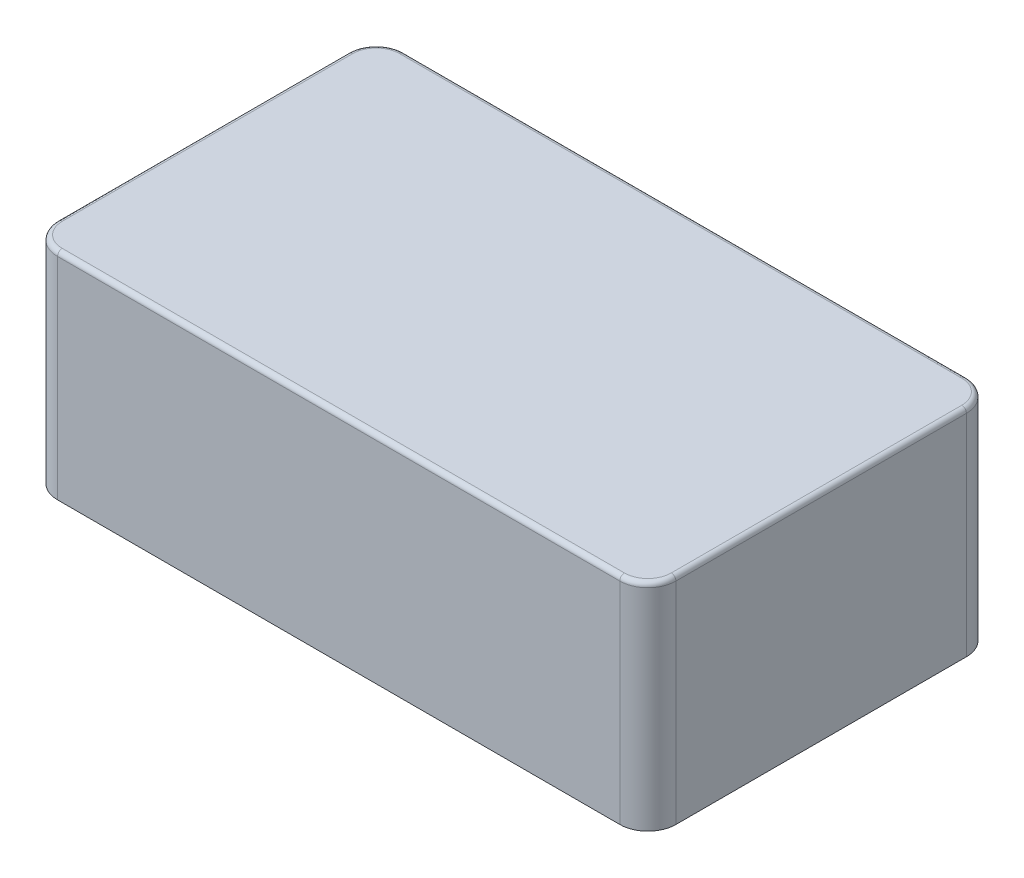
ISO-10303-21;
HEADER;
FILE_DESCRIPTION(('STEP AP214'),'2;1');
FILE_NAME('part.step','',(''),(''),'','','');
FILE_SCHEMA(('AUTOMOTIVE_DESIGN { 1 0 10303 214 1 1 1 1 }'));
ENDSEC;
DATA;
#1=APPLICATION_CONTEXT('core data for automotive mechanical design processes');
#2=APPLICATION_PROTOCOL_DEFINITION('international standard','automotive_design',2000,#1);
#3=PRODUCT_CONTEXT('',#1,'mechanical');
#4=PRODUCT('Part','Part','',(#3));
#5=PRODUCT_RELATED_PRODUCT_CATEGORY('part','',(#4));
#6=PRODUCT_DEFINITION_FORMATION('','',#4);
#7=PRODUCT_DEFINITION_CONTEXT('part definition',#1,'design');
#8=PRODUCT_DEFINITION('design','',#6,#7);
#9=PRODUCT_DEFINITION_SHAPE('','',#8);
#10=(LENGTH_UNIT() NAMED_UNIT(*) SI_UNIT(.MILLI.,.METRE.));
#11=(NAMED_UNIT(*) PLANE_ANGLE_UNIT() SI_UNIT($,.RADIAN.));
#12=(NAMED_UNIT(*) SI_UNIT($,.STERADIAN.) SOLID_ANGLE_UNIT());
#13=UNCERTAINTY_MEASURE_WITH_UNIT(LENGTH_MEASURE(1.E-05),#10,'distance_accuracy_value','');
#14=(GEOMETRIC_REPRESENTATION_CONTEXT(3) GLOBAL_UNCERTAINTY_ASSIGNED_CONTEXT((#13)) GLOBAL_UNIT_ASSIGNED_CONTEXT((#10,
#11,#12)) REPRESENTATION_CONTEXT('',''));
#15=CARTESIAN_POINT('',(0.,0.,0.));
#16=DIRECTION('',(0.,0.,1.));
#17=DIRECTION('',(1.,0.,0.));
#18=AXIS2_PLACEMENT_3D('',#15,#16,#17);
#19=CARTESIAN_POINT('',(30.,0.,-15.5));
#20=DIRECTION('',(0.,-1.,0.));
#21=DIRECTION('',(0.,0.,-1.));
#22=AXIS2_PLACEMENT_3D('',#19,#20,#21);
#23=PLANE('',#22);
#24=CARTESIAN_POINT('',(30.,0.,-15.5));
#25=DIRECTION('',(0.,1.,0.));
#26=DIRECTION('',(0.,0.,-1.));
#27=AXIS2_PLACEMENT_3D('',#24,#25,#26);
#28=CIRCLE('',#27,3.);
#29=CARTESIAN_POINT('',(33.,0.,-15.5));
#30=VERTEX_POINT('',#29);
#31=CARTESIAN_POINT('',(30.,0.,-18.5));
#32=VERTEX_POINT('',#31);
#33=EDGE_CURVE('E236',#30,#32,#28,.T.);
#34=ORIENTED_EDGE('',*,*,#33,.F.);
#35=DIRECTION('',(0.,0.,-1.));
#36=VECTOR('',#35,1.);
#37=CARTESIAN_POINT('',(33.,0.,-15.5));
#38=LINE('',#37,#36);
#39=CARTESIAN_POINT('',(33.,0.,15.5));
#40=VERTEX_POINT('',#39);
#41=EDGE_CURVE('E257',#40,#30,#38,.T.);
#42=ORIENTED_EDGE('',*,*,#41,.F.);
#43=CARTESIAN_POINT('',(30.,0.,15.5));
#44=DIRECTION('',(0.,1.,0.));
#45=DIRECTION('',(0.,0.,1.));
#46=AXIS2_PLACEMENT_3D('',#43,#44,#45);
#47=CIRCLE('',#46,3.);
#48=CARTESIAN_POINT('',(30.,0.,18.5));
#49=VERTEX_POINT('',#48);
#50=EDGE_CURVE('E254',#49,#40,#47,.T.);
#51=ORIENTED_EDGE('',*,*,#50,.F.);
#52=DIRECTION('',(1.,0.,0.));
#53=VECTOR('',#52,1.);
#54=CARTESIAN_POINT('',(-30.,0.,18.5));
#55=LINE('',#54,#53);
#56=CARTESIAN_POINT('',(-30.,0.,18.5));
#57=VERTEX_POINT('',#56);
#58=EDGE_CURVE('E251',#57,#49,#55,.T.);
#59=ORIENTED_EDGE('',*,*,#58,.F.);
#60=CARTESIAN_POINT('',(-30.,0.,15.5));
#61=DIRECTION('',(0.,1.,0.));
#62=DIRECTION('',(0.,0.,-1.));
#63=AXIS2_PLACEMENT_3D('',#60,#61,#62);
#64=CIRCLE('',#63,3.);
#65=CARTESIAN_POINT('',(-33.,0.,15.5));
#66=VERTEX_POINT('',#65);
#67=EDGE_CURVE('E248',#66,#57,#64,.T.);
#68=ORIENTED_EDGE('',*,*,#67,.F.);
#69=DIRECTION('',(0.,0.,1.));
#70=VECTOR('',#69,1.);
#71=CARTESIAN_POINT('',(-33.,0.,-15.5));
#72=LINE('',#71,#70);
#73=CARTESIAN_POINT('',(-33.,0.,-15.5));
#74=VERTEX_POINT('',#73);
#75=EDGE_CURVE('E245',#74,#66,#72,.T.);
#76=ORIENTED_EDGE('',*,*,#75,.F.);
#77=CARTESIAN_POINT('',(-30.,0.,-15.5));
#78=DIRECTION('',(0.,1.,0.));
#79=DIRECTION('',(0.,0.,-1.));
#80=AXIS2_PLACEMENT_3D('',#77,#78,#79);
#81=CIRCLE('',#80,3.);
#82=CARTESIAN_POINT('',(-30.,0.,-18.5));
#83=VERTEX_POINT('',#82);
#84=EDGE_CURVE('E242',#83,#74,#81,.T.);
#85=ORIENTED_EDGE('',*,*,#84,.F.);
#86=DIRECTION('',(-1.,0.,0.));
#87=VECTOR('',#86,1.);
#88=CARTESIAN_POINT('',(-30.,0.,-18.5));
#89=LINE('',#88,#87);
#90=EDGE_CURVE('E239',#32,#83,#89,.T.);
#91=ORIENTED_EDGE('',*,*,#90,.F.);
#92=EDGE_LOOP('',(#34,#42,#51,#59,#68,#76,#85,#91));
#93=FACE_BOUND('',#92,.T.);
#94=DIRECTION('',(0.,0.,-1.));
#95=VECTOR('',#94,1.);
#96=CARTESIAN_POINT('',(31.,0.,-13.5));
#97=LINE('',#96,#95);
#98=CARTESIAN_POINT('',(31.,0.,13.5));
#99=VERTEX_POINT('',#98);
#100=CARTESIAN_POINT('',(31.,0.,-13.5));
#101=VERTEX_POINT('',#100);
#102=EDGE_CURVE('E188',#99,#101,#97,.T.);
#103=ORIENTED_EDGE('',*,*,#102,.T.);
#104=CARTESIAN_POINT('',(28.,0.,-13.5));
#105=DIRECTION('',(0.,1.,0.));
#106=DIRECTION('',(0.,0.,1.));
#107=AXIS2_PLACEMENT_3D('',#104,#105,#106);
#108=CIRCLE('',#107,3.);
#109=CARTESIAN_POINT('',(28.,0.,-16.5));
#110=VERTEX_POINT('',#109);
#111=EDGE_CURVE('E202',#101,#110,#108,.T.);
#112=ORIENTED_EDGE('',*,*,#111,.T.);
#113=DIRECTION('',(-1.,0.,0.));
#114=VECTOR('',#113,1.);
#115=CARTESIAN_POINT('',(-28.,0.,-16.5));
#116=LINE('',#115,#114);
#117=CARTESIAN_POINT('',(-28.,0.,-16.5));
#118=VERTEX_POINT('',#117);
#119=EDGE_CURVE('E205',#110,#118,#116,.T.);
#120=ORIENTED_EDGE('',*,*,#119,.T.);
#121=CARTESIAN_POINT('',(-28.,0.,-13.5));
#122=DIRECTION('',(0.,1.,0.));
#123=DIRECTION('',(0.,0.,-1.));
#124=AXIS2_PLACEMENT_3D('',#121,#122,#123);
#125=CIRCLE('',#124,3.);
#126=CARTESIAN_POINT('',(-31.,0.,-13.5));
#127=VERTEX_POINT('',#126);
#128=EDGE_CURVE('E208',#118,#127,#125,.T.);
#129=ORIENTED_EDGE('',*,*,#128,.T.);
#130=DIRECTION('',(0.,0.,1.));
#131=VECTOR('',#130,1.);
#132=CARTESIAN_POINT('',(-31.,0.,-13.5));
#133=LINE('',#132,#131);
#134=CARTESIAN_POINT('',(-31.,0.,13.5));
#135=VERTEX_POINT('',#134);
#136=EDGE_CURVE('E211',#127,#135,#133,.T.);
#137=ORIENTED_EDGE('',*,*,#136,.T.);
#138=CARTESIAN_POINT('',(-28.,0.,13.5));
#139=DIRECTION('',(0.,1.,0.));
#140=DIRECTION('',(0.,0.,-1.));
#141=AXIS2_PLACEMENT_3D('',#138,#139,#140);
#142=CIRCLE('',#141,3.);
#143=CARTESIAN_POINT('',(-28.,0.,16.5));
#144=VERTEX_POINT('',#143);
#145=EDGE_CURVE('E214',#135,#144,#142,.T.);
#146=ORIENTED_EDGE('',*,*,#145,.T.);
#147=DIRECTION('',(1.,0.,0.));
#148=VECTOR('',#147,1.);
#149=CARTESIAN_POINT('',(-28.,0.,16.5));
#150=LINE('',#149,#148);
#151=CARTESIAN_POINT('',(28.,0.,16.5));
#152=VERTEX_POINT('',#151);
#153=EDGE_CURVE('E217',#144,#152,#150,.T.);
#154=ORIENTED_EDGE('',*,*,#153,.T.);
#155=CARTESIAN_POINT('',(28.,0.,13.5));
#156=DIRECTION('',(0.,1.,0.));
#157=DIRECTION('',(0.,0.,1.));
#158=AXIS2_PLACEMENT_3D('',#155,#156,#157);
#159=CIRCLE('',#158,3.);
#160=EDGE_CURVE('E220',#152,#99,#159,.T.);
#161=ORIENTED_EDGE('',*,*,#160,.T.);
#162=EDGE_LOOP('',(#103,#112,#120,#129,#137,#146,#154,#161));
#163=FACE_BOUND('',#162,.T.);
#164=ADVANCED_FACE('F34',(#93,#163),#23,.T.);
#165=CARTESIAN_POINT('',(30.,21.,-15.5));
#166=DIRECTION('',(0.,-1.,0.));
#167=DIRECTION('',(0.,0.,-1.));
#168=AXIS2_PLACEMENT_3D('',#165,#166,#167);
#169=CYLINDRICAL_SURFACE('',#168,3.);
#170=DIRECTION('',(0.,-1.,0.));
#171=VECTOR('',#170,1.);
#172=CARTESIAN_POINT('',(30.,21.,-18.5));
#173=LINE('',#172,#171);
#174=CARTESIAN_POINT('',(30.,22.5,-18.5));
#175=VERTEX_POINT('',#174);
#176=EDGE_CURVE('E274',#175,#32,#173,.T.);
#177=ORIENTED_EDGE('',*,*,#176,.F.);
#178=CARTESIAN_POINT('',(30.,22.5,-15.5));
#179=DIRECTION('',(0.,1.,0.));
#180=DIRECTION('',(0.,0.,1.));
#181=AXIS2_PLACEMENT_3D('',#178,#179,#180);
#182=CIRCLE('',#181,3.);
#183=CARTESIAN_POINT('',(33.,22.5,-15.5));
#184=VERTEX_POINT('',#183);
#185=EDGE_CURVE('E300',#175,#184,#182,.F.);
#186=ORIENTED_EDGE('',*,*,#185,.T.);
#187=DIRECTION('',(0.,-1.,0.));
#188=VECTOR('',#187,1.);
#189=CARTESIAN_POINT('',(33.,21.,-15.5));
#190=LINE('',#189,#188);
#191=EDGE_CURVE('E260',#184,#30,#190,.T.);
#192=ORIENTED_EDGE('',*,*,#191,.T.);
#193=ORIENTED_EDGE('',*,*,#33,.T.);
#194=EDGE_LOOP('',(#177,#186,#192,#193));
#195=FACE_BOUND('',#194,.T.);
#196=ADVANCED_FACE('F350',(#195),#169,.T.);
#197=CARTESIAN_POINT('',(-30.,21.,-18.5));
#198=DIRECTION('',(0.,0.,1.));
#199=DIRECTION('',(1.,0.,0.));
#200=AXIS2_PLACEMENT_3D('',#197,#198,#199);
#201=PLANE('',#200);
#202=DIRECTION('',(0.,-1.,0.));
#203=VECTOR('',#202,1.);
#204=CARTESIAN_POINT('',(-30.,21.,-18.5));
#205=LINE('',#204,#203);
#206=CARTESIAN_POINT('',(-30.,22.5,-18.5));
#207=VERTEX_POINT('',#206);
#208=EDGE_CURVE('E272',#207,#83,#205,.T.);
#209=ORIENTED_EDGE('',*,*,#208,.F.);
#210=DIRECTION('',(-1.,0.,0.));
#211=VECTOR('',#210,1.);
#212=CARTESIAN_POINT('',(30.,22.5,-18.5));
#213=LINE('',#212,#211);
#214=EDGE_CURVE('E298',#207,#175,#213,.F.);
#215=ORIENTED_EDGE('',*,*,#214,.T.);
#216=ORIENTED_EDGE('',*,*,#176,.T.);
#217=ORIENTED_EDGE('',*,*,#90,.T.);
#218=EDGE_LOOP('',(#209,#215,#216,#217));
#219=FACE_BOUND('',#218,.T.);
#220=ADVANCED_FACE('F353',(#219),#201,.F.);
#221=CARTESIAN_POINT('',(-30.,21.,-15.5));
#222=DIRECTION('',(0.,-1.,0.));
#223=DIRECTION('',(0.,0.,-1.));
#224=AXIS2_PLACEMENT_3D('',#221,#222,#223);
#225=CYLINDRICAL_SURFACE('',#224,3.);
#226=DIRECTION('',(0.,-1.,0.));
#227=VECTOR('',#226,1.);
#228=CARTESIAN_POINT('',(-33.,21.,-15.5));
#229=LINE('',#228,#227);
#230=CARTESIAN_POINT('',(-33.,22.5,-15.5));
#231=VERTEX_POINT('',#230);
#232=EDGE_CURVE('E270',#231,#74,#229,.T.);
#233=ORIENTED_EDGE('',*,*,#232,.F.);
#234=CARTESIAN_POINT('',(-30.,22.5,-15.5));
#235=DIRECTION('',(0.,1.,0.));
#236=DIRECTION('',(0.,0.,1.));
#237=AXIS2_PLACEMENT_3D('',#234,#235,#236);
#238=CIRCLE('',#237,3.);
#239=EDGE_CURVE('E296',#231,#207,#238,.F.);
#240=ORIENTED_EDGE('',*,*,#239,.T.);
#241=ORIENTED_EDGE('',*,*,#208,.T.);
#242=ORIENTED_EDGE('',*,*,#84,.T.);
#243=EDGE_LOOP('',(#233,#240,#241,#242));
#244=FACE_BOUND('',#243,.T.);
#245=ADVANCED_FACE('F417',(#244),#225,.T.);
#246=CARTESIAN_POINT('',(-33.,21.,-15.5));
#247=DIRECTION('',(1.,0.,0.));
#248=DIRECTION('',(0.,0.,-1.));
#249=AXIS2_PLACEMENT_3D('',#246,#247,#248);
#250=PLANE('',#249);
#251=DIRECTION('',(0.,-1.,0.));
#252=VECTOR('',#251,1.);
#253=CARTESIAN_POINT('',(-33.,21.,15.5));
#254=LINE('',#253,#252);
#255=CARTESIAN_POINT('',(-33.,22.5,15.5));
#256=VERTEX_POINT('',#255);
#257=EDGE_CURVE('E268',#256,#66,#254,.T.);
#258=ORIENTED_EDGE('',*,*,#257,.F.);
#259=DIRECTION('',(0.,0.,1.));
#260=VECTOR('',#259,1.);
#261=CARTESIAN_POINT('',(-33.,22.5,-15.5));
#262=LINE('',#261,#260);
#263=EDGE_CURVE('E293',#256,#231,#262,.F.);
#264=ORIENTED_EDGE('',*,*,#263,.T.);
#265=ORIENTED_EDGE('',*,*,#232,.T.);
#266=ORIENTED_EDGE('',*,*,#75,.T.);
#267=EDGE_LOOP('',(#258,#264,#265,#266));
#268=FACE_BOUND('',#267,.T.);
#269=ADVANCED_FACE('F383',(#268),#250,.F.);
#270=CARTESIAN_POINT('',(-30.,21.,15.5));
#271=DIRECTION('',(0.,-1.,0.));
#272=DIRECTION('',(0.,0.,-1.));
#273=AXIS2_PLACEMENT_3D('',#270,#271,#272);
#274=CYLINDRICAL_SURFACE('',#273,3.);
#275=DIRECTION('',(0.,-1.,0.));
#276=VECTOR('',#275,1.);
#277=CARTESIAN_POINT('',(-30.,21.,18.5));
#278=LINE('',#277,#276);
#279=CARTESIAN_POINT('',(-30.,22.5,18.5));
#280=VERTEX_POINT('',#279);
#281=EDGE_CURVE('E266',#280,#57,#278,.T.);
#282=ORIENTED_EDGE('',*,*,#281,.F.);
#283=CARTESIAN_POINT('',(-30.,22.5,15.5));
#284=DIRECTION('',(0.,1.,0.));
#285=DIRECTION('',(0.,0.,1.));
#286=AXIS2_PLACEMENT_3D('',#283,#284,#285);
#287=CIRCLE('',#286,3.);
#288=EDGE_CURVE('E11',#280,#256,#287,.F.);
#289=ORIENTED_EDGE('',*,*,#288,.T.);
#290=ORIENTED_EDGE('',*,*,#257,.T.);
#291=ORIENTED_EDGE('',*,*,#67,.T.);
#292=EDGE_LOOP('',(#282,#289,#290,#291));
#293=FACE_BOUND('',#292,.T.);
#294=ADVANCED_FACE('F380',(#293),#274,.T.);
#295=CARTESIAN_POINT('',(-30.,21.,18.5));
#296=DIRECTION('',(0.,0.,-1.));
#297=DIRECTION('',(-1.,0.,0.));
#298=AXIS2_PLACEMENT_3D('',#295,#296,#297);
#299=PLANE('',#298);
#300=DIRECTION('',(0.,-1.,0.));
#301=VECTOR('',#300,1.);
#302=CARTESIAN_POINT('',(30.,21.,18.5));
#303=LINE('',#302,#301);
#304=CARTESIAN_POINT('',(30.,22.5,18.5));
#305=VERTEX_POINT('',#304);
#306=EDGE_CURVE('E264',#305,#49,#303,.T.);
#307=ORIENTED_EDGE('',*,*,#306,.F.);
#308=DIRECTION('',(1.,0.,0.));
#309=VECTOR('',#308,1.);
#310=CARTESIAN_POINT('',(-30.,22.5,18.5));
#311=LINE('',#310,#309);
#312=EDGE_CURVE('E43',#305,#280,#311,.F.);
#313=ORIENTED_EDGE('',*,*,#312,.T.);
#314=ORIENTED_EDGE('',*,*,#281,.T.);
#315=ORIENTED_EDGE('',*,*,#58,.T.);
#316=EDGE_LOOP('',(#307,#313,#314,#315));
#317=FACE_BOUND('',#316,.T.);
#318=ADVANCED_FACE('F410',(#317),#299,.F.);
#319=CARTESIAN_POINT('',(30.,21.,15.5));
#320=DIRECTION('',(0.,-1.,0.));
#321=DIRECTION('',(0.,0.,-1.));
#322=AXIS2_PLACEMENT_3D('',#319,#320,#321);
#323=CYLINDRICAL_SURFACE('',#322,3.);
#324=DIRECTION('',(0.,-1.,0.));
#325=VECTOR('',#324,1.);
#326=CARTESIAN_POINT('',(33.,21.,15.5));
#327=LINE('',#326,#325);
#328=CARTESIAN_POINT('',(33.,22.5,15.5));
#329=VERTEX_POINT('',#328);
#330=EDGE_CURVE('E262',#329,#40,#327,.T.);
#331=ORIENTED_EDGE('',*,*,#330,.F.);
#332=CARTESIAN_POINT('',(30.,22.5,15.5));
#333=DIRECTION('',(0.,1.,0.));
#334=DIRECTION('',(0.,0.,1.));
#335=AXIS2_PLACEMENT_3D('',#332,#333,#334);
#336=CIRCLE('',#335,3.);
#337=EDGE_CURVE('E58',#329,#305,#336,.F.);
#338=ORIENTED_EDGE('',*,*,#337,.T.);
#339=ORIENTED_EDGE('',*,*,#306,.T.);
#340=ORIENTED_EDGE('',*,*,#50,.T.);
#341=EDGE_LOOP('',(#331,#338,#339,#340));
#342=FACE_BOUND('',#341,.T.);
#343=ADVANCED_FACE('F339',(#342),#323,.T.);
#344=CARTESIAN_POINT('',(33.,21.,-15.5));
#345=DIRECTION('',(-1.,0.,0.));
#346=DIRECTION('',(0.,0.,1.));
#347=AXIS2_PLACEMENT_3D('',#344,#345,#346);
#348=PLANE('',#347);
#349=ORIENTED_EDGE('',*,*,#191,.F.);
#350=DIRECTION('',(0.,0.,-1.));
#351=VECTOR('',#350,1.);
#352=CARTESIAN_POINT('',(33.,22.5,15.5));
#353=LINE('',#352,#351);
#354=EDGE_CURVE('E302',#184,#329,#353,.F.);
#355=ORIENTED_EDGE('',*,*,#354,.T.);
#356=ORIENTED_EDGE('',*,*,#330,.T.);
#357=ORIENTED_EDGE('',*,*,#41,.T.);
#358=EDGE_LOOP('',(#349,#355,#356,#357));
#359=FACE_BOUND('',#358,.T.);
#360=ADVANCED_FACE('F338',(#359),#348,.F.);
#361=CARTESIAN_POINT('',(28.,21.,-13.5));
#362=DIRECTION('',(0.,-1.,0.));
#363=DIRECTION('',(0.,0.,-1.));
#364=AXIS2_PLACEMENT_3D('',#361,#362,#363);
#365=CYLINDRICAL_SURFACE('',#364,3.);
#366=ORIENTED_EDGE('',*,*,#111,.F.);
#367=DIRECTION('',(0.,-1.,0.));
#368=VECTOR('',#367,1.);
#369=CARTESIAN_POINT('',(31.,21.,-13.5));
#370=LINE('',#369,#368);
#371=CARTESIAN_POINT('',(31.,21.,-13.5));
#372=VERTEX_POINT('',#371);
#373=EDGE_CURVE('E182',#372,#101,#370,.T.);
#374=ORIENTED_EDGE('',*,*,#373,.F.);
#375=CARTESIAN_POINT('',(28.,21.,-13.5));
#376=DIRECTION('',(0.,1.,0.));
#377=DIRECTION('',(0.,0.,1.));
#378=AXIS2_PLACEMENT_3D('',#375,#376,#377);
#379=CIRCLE('',#378,3.);
#380=CARTESIAN_POINT('',(28.,21.,-16.5));
#381=VERTEX_POINT('',#380);
#382=EDGE_CURVE('E178',#372,#381,#379,.T.);
#383=ORIENTED_EDGE('',*,*,#382,.T.);
#384=DIRECTION('',(0.,-1.,0.));
#385=VECTOR('',#384,1.);
#386=CARTESIAN_POINT('',(28.,21.,-16.5));
#387=LINE('',#386,#385);
#388=EDGE_CURVE('E233',#381,#110,#387,.T.);
#389=ORIENTED_EDGE('',*,*,#388,.T.);
#390=EDGE_LOOP('',(#366,#374,#383,#389));
#391=FACE_BOUND('',#390,.T.);
#392=ADVANCED_FACE('F404',(#391),#365,.F.);
#393=CARTESIAN_POINT('',(-28.,21.,-16.5));
#394=DIRECTION('',(0.,0.,1.));
#395=DIRECTION('',(1.,0.,0.));
#396=AXIS2_PLACEMENT_3D('',#393,#394,#395);
#397=PLANE('',#396);
#398=ORIENTED_EDGE('',*,*,#119,.F.);
#399=ORIENTED_EDGE('',*,*,#388,.F.);
#400=DIRECTION('',(-1.,0.,0.));
#401=VECTOR('',#400,1.);
#402=CARTESIAN_POINT('',(-28.,21.,-16.5));
#403=LINE('',#402,#401);
#404=CARTESIAN_POINT('',(-28.,21.,-16.5));
#405=VERTEX_POINT('',#404);
#406=EDGE_CURVE('E655',#381,#405,#403,.T.);
#407=ORIENTED_EDGE('',*,*,#406,.T.);
#408=DIRECTION('',(0.,-1.,0.));
#409=VECTOR('',#408,1.);
#410=CARTESIAN_POINT('',(-28.,21.,-16.5));
#411=LINE('',#410,#409);
#412=EDGE_CURVE('E231',#405,#118,#411,.T.);
#413=ORIENTED_EDGE('',*,*,#412,.T.);
#414=EDGE_LOOP('',(#398,#399,#407,#413));
#415=FACE_BOUND('',#414,.T.);
#416=ADVANCED_FACE('F615',(#415),#397,.T.);
#417=CARTESIAN_POINT('',(-28.,21.,-13.5));
#418=DIRECTION('',(0.,-1.,0.));
#419=DIRECTION('',(0.,0.,-1.));
#420=AXIS2_PLACEMENT_3D('',#417,#418,#419);
#421=CYLINDRICAL_SURFACE('',#420,3.);
#422=ORIENTED_EDGE('',*,*,#128,.F.);
#423=ORIENTED_EDGE('',*,*,#412,.F.);
#424=CARTESIAN_POINT('',(-28.,21.,-13.5));
#425=DIRECTION('',(0.,1.,0.));
#426=DIRECTION('',(0.,0.,-1.));
#427=AXIS2_PLACEMENT_3D('',#424,#425,#426);
#428=CIRCLE('',#427,3.);
#429=CARTESIAN_POINT('',(-31.,21.,-13.5));
#430=VERTEX_POINT('',#429);
#431=EDGE_CURVE('E650',#405,#430,#428,.T.);
#432=ORIENTED_EDGE('',*,*,#431,.T.);
#433=DIRECTION('',(0.,-1.,0.));
#434=VECTOR('',#433,1.);
#435=CARTESIAN_POINT('',(-31.,21.,-13.5));
#436=LINE('',#435,#434);
#437=EDGE_CURVE('E229',#430,#127,#436,.T.);
#438=ORIENTED_EDGE('',*,*,#437,.T.);
#439=EDGE_LOOP('',(#422,#423,#432,#438));
#440=FACE_BOUND('',#439,.T.);
#441=ADVANCED_FACE('F606',(#440),#421,.F.);
#442=CARTESIAN_POINT('',(-31.,21.,-13.5));
#443=DIRECTION('',(1.,0.,0.));
#444=DIRECTION('',(0.,0.,-1.));
#445=AXIS2_PLACEMENT_3D('',#442,#443,#444);
#446=PLANE('',#445);
#447=ORIENTED_EDGE('',*,*,#136,.F.);
#448=ORIENTED_EDGE('',*,*,#437,.F.);
#449=DIRECTION('',(0.,0.,1.));
#450=VECTOR('',#449,1.);
#451=CARTESIAN_POINT('',(-31.,21.,-13.5));
#452=LINE('',#451,#450);
#453=CARTESIAN_POINT('',(-31.,21.,13.5));
#454=VERTEX_POINT('',#453);
#455=EDGE_CURVE('E649',#430,#454,#452,.T.);
#456=ORIENTED_EDGE('',*,*,#455,.T.);
#457=DIRECTION('',(0.,-1.,0.));
#458=VECTOR('',#457,1.);
#459=CARTESIAN_POINT('',(-31.,21.,13.5));
#460=LINE('',#459,#458);
#461=EDGE_CURVE('E227',#454,#135,#460,.T.);
#462=ORIENTED_EDGE('',*,*,#461,.T.);
#463=EDGE_LOOP('',(#447,#448,#456,#462));
#464=FACE_BOUND('',#463,.T.);
#465=ADVANCED_FACE('F597',(#464),#446,.T.);
#466=CARTESIAN_POINT('',(-28.,21.,13.5));
#467=DIRECTION('',(0.,-1.,0.));
#468=DIRECTION('',(0.,0.,-1.));
#469=AXIS2_PLACEMENT_3D('',#466,#467,#468);
#470=CYLINDRICAL_SURFACE('',#469,3.);
#471=ORIENTED_EDGE('',*,*,#145,.F.);
#472=ORIENTED_EDGE('',*,*,#461,.F.);
#473=CARTESIAN_POINT('',(-28.,21.,13.5));
#474=DIRECTION('',(0.,1.,0.));
#475=DIRECTION('',(0.,0.,-1.));
#476=AXIS2_PLACEMENT_3D('',#473,#474,#475);
#477=CIRCLE('',#476,3.);
#478=CARTESIAN_POINT('',(-28.,21.,16.5));
#479=VERTEX_POINT('',#478);
#480=EDGE_CURVE('E198',#454,#479,#477,.T.);
#481=ORIENTED_EDGE('',*,*,#480,.T.);
#482=DIRECTION('',(0.,-1.,0.));
#483=VECTOR('',#482,1.);
#484=CARTESIAN_POINT('',(-28.,21.,16.5));
#485=LINE('',#484,#483);
#486=EDGE_CURVE('E225',#479,#144,#485,.T.);
#487=ORIENTED_EDGE('',*,*,#486,.T.);
#488=EDGE_LOOP('',(#471,#472,#481,#487));
#489=FACE_BOUND('',#488,.T.);
#490=ADVANCED_FACE('F588',(#489),#470,.F.);
#491=CARTESIAN_POINT('',(-28.,21.,16.5));
#492=DIRECTION('',(0.,0.,-1.));
#493=DIRECTION('',(-1.,0.,0.));
#494=AXIS2_PLACEMENT_3D('',#491,#492,#493);
#495=PLANE('',#494);
#496=ORIENTED_EDGE('',*,*,#153,.F.);
#497=ORIENTED_EDGE('',*,*,#486,.F.);
#498=DIRECTION('',(1.,0.,0.));
#499=VECTOR('',#498,1.);
#500=CARTESIAN_POINT('',(-28.,21.,16.5));
#501=LINE('',#500,#499);
#502=CARTESIAN_POINT('',(28.,21.,16.5));
#503=VERTEX_POINT('',#502);
#504=EDGE_CURVE('E196',#479,#503,#501,.T.);
#505=ORIENTED_EDGE('',*,*,#504,.T.);
#506=DIRECTION('',(0.,-1.,0.));
#507=VECTOR('',#506,1.);
#508=CARTESIAN_POINT('',(28.,21.,16.5));
#509=LINE('',#508,#507);
#510=EDGE_CURVE('E192',#503,#152,#509,.T.);
#511=ORIENTED_EDGE('',*,*,#510,.T.);
#512=EDGE_LOOP('',(#496,#497,#505,#511));
#513=FACE_BOUND('',#512,.T.);
#514=ADVANCED_FACE('F580',(#513),#495,.T.);
#515=CARTESIAN_POINT('',(28.,21.,13.5));
#516=DIRECTION('',(0.,-1.,0.));
#517=DIRECTION('',(0.,0.,-1.));
#518=AXIS2_PLACEMENT_3D('',#515,#516,#517);
#519=CYLINDRICAL_SURFACE('',#518,3.);
#520=ORIENTED_EDGE('',*,*,#160,.F.);
#521=ORIENTED_EDGE('',*,*,#510,.F.);
#522=CARTESIAN_POINT('',(28.,21.,13.5));
#523=DIRECTION('',(0.,1.,0.));
#524=DIRECTION('',(0.,0.,1.));
#525=AXIS2_PLACEMENT_3D('',#522,#523,#524);
#526=CIRCLE('',#525,3.);
#527=CARTESIAN_POINT('',(31.,21.,13.5));
#528=VERTEX_POINT('',#527);
#529=EDGE_CURVE('E175',#503,#528,#526,.T.);
#530=ORIENTED_EDGE('',*,*,#529,.T.);
#531=DIRECTION('',(0.,-1.,0.));
#532=VECTOR('',#531,1.);
#533=CARTESIAN_POINT('',(31.,21.,13.5));
#534=LINE('',#533,#532);
#535=EDGE_CURVE('E185',#528,#99,#534,.T.);
#536=ORIENTED_EDGE('',*,*,#535,.T.);
#537=EDGE_LOOP('',(#520,#521,#530,#536));
#538=FACE_BOUND('',#537,.T.);
#539=ADVANCED_FACE('F195',(#538),#519,.F.);
#540=CARTESIAN_POINT('',(31.,21.,-13.5));
#541=DIRECTION('',(-1.,0.,0.));
#542=DIRECTION('',(0.,0.,1.));
#543=AXIS2_PLACEMENT_3D('',#540,#541,#542);
#544=PLANE('',#543);
#545=ORIENTED_EDGE('',*,*,#102,.F.);
#546=ORIENTED_EDGE('',*,*,#535,.F.);
#547=DIRECTION('',(0.,0.,-1.));
#548=VECTOR('',#547,1.);
#549=CARTESIAN_POINT('',(31.,21.,-13.5));
#550=LINE('',#549,#548);
#551=EDGE_CURVE('E171',#528,#372,#550,.T.);
#552=ORIENTED_EDGE('',*,*,#551,.T.);
#553=ORIENTED_EDGE('',*,*,#373,.T.);
#554=EDGE_LOOP('',(#545,#546,#552,#553));
#555=FACE_BOUND('',#554,.T.);
#556=ADVANCED_FACE('F186',(#555),#544,.T.);
#557=CARTESIAN_POINT('',(-30.,21.,15.5));
#558=DIRECTION('',(0.,1.,0.));
#559=DIRECTION('',(0.,0.,1.));
#560=AXIS2_PLACEMENT_3D('',#557,#558,#559);
#561=PLANE('',#560);
#562=ORIENTED_EDGE('',*,*,#382,.F.);
#563=ORIENTED_EDGE('',*,*,#551,.F.);
#564=ORIENTED_EDGE('',*,*,#529,.F.);
#565=ORIENTED_EDGE('',*,*,#504,.F.);
#566=ORIENTED_EDGE('',*,*,#480,.F.);
#567=ORIENTED_EDGE('',*,*,#455,.F.);
#568=ORIENTED_EDGE('',*,*,#431,.F.);
#569=ORIENTED_EDGE('',*,*,#406,.F.);
#570=EDGE_LOOP('',(#562,#563,#564,#565,#566,#567,#568,#569));
#571=FACE_BOUND('',#570,.T.);
#572=ADVANCED_FACE('F173',(#571),#561,.F.);
#573=CARTESIAN_POINT('',(-30.,23.,15.5));
#574=DIRECTION('',(0.,1.,0.));
#575=DIRECTION('',(0.,0.,1.));
#576=AXIS2_PLACEMENT_3D('',#573,#574,#575);
#577=PLANE('',#576);
#578=CARTESIAN_POINT('',(-30.,23.,-15.5));
#579=DIRECTION('',(0.,1.,0.));
#580=DIRECTION('',(0.,0.,1.));
#581=AXIS2_PLACEMENT_3D('',#578,#579,#580);
#582=CIRCLE('',#581,2.5);
#583=CARTESIAN_POINT('',(-30.,23.,-18.));
#584=VERTEX_POINT('',#583);
#585=CARTESIAN_POINT('',(-32.5,23.,-15.5));
#586=VERTEX_POINT('',#585);
#587=EDGE_CURVE('E288',#584,#586,#582,.T.);
#588=ORIENTED_EDGE('',*,*,#587,.T.);
#589=DIRECTION('',(0.,0.,1.));
#590=VECTOR('',#589,1.);
#591=CARTESIAN_POINT('',(-32.5,23.,15.5));
#592=LINE('',#591,#590);
#593=CARTESIAN_POINT('',(-32.5,23.,15.5));
#594=VERTEX_POINT('',#593);
#595=EDGE_CURVE('E290',#586,#594,#592,.T.);
#596=ORIENTED_EDGE('',*,*,#595,.T.);
#597=CARTESIAN_POINT('',(-30.,23.,15.5));
#598=DIRECTION('',(0.,1.,0.));
#599=DIRECTION('',(0.,0.,1.));
#600=AXIS2_PLACEMENT_3D('',#597,#598,#599);
#601=CIRCLE('',#600,2.5);
#602=CARTESIAN_POINT('',(-30.,23.,18.));
#603=VERTEX_POINT('',#602);
#604=EDGE_CURVE('E276',#594,#603,#601,.T.);
#605=ORIENTED_EDGE('',*,*,#604,.T.);
#606=DIRECTION('',(1.,0.,0.));
#607=VECTOR('',#606,1.);
#608=CARTESIAN_POINT('',(30.,23.,18.));
#609=LINE('',#608,#607);
#610=CARTESIAN_POINT('',(30.,23.,18.));
#611=VERTEX_POINT('',#610);
#612=EDGE_CURVE('E278',#603,#611,#609,.T.);
#613=ORIENTED_EDGE('',*,*,#612,.T.);
#614=CARTESIAN_POINT('',(30.,23.,15.5));
#615=DIRECTION('',(0.,1.,0.));
#616=DIRECTION('',(0.,0.,1.));
#617=AXIS2_PLACEMENT_3D('',#614,#615,#616);
#618=CIRCLE('',#617,2.5);
#619=CARTESIAN_POINT('',(32.5,23.,15.5));
#620=VERTEX_POINT('',#619);
#621=EDGE_CURVE('E280',#611,#620,#618,.T.);
#622=ORIENTED_EDGE('',*,*,#621,.T.);
#623=DIRECTION('',(0.,0.,-1.));
#624=VECTOR('',#623,1.);
#625=CARTESIAN_POINT('',(32.5,23.,-15.5));
#626=LINE('',#625,#624);
#627=CARTESIAN_POINT('',(32.5,23.,-15.5));
#628=VERTEX_POINT('',#627);
#629=EDGE_CURVE('E282',#620,#628,#626,.T.);
#630=ORIENTED_EDGE('',*,*,#629,.T.);
#631=CARTESIAN_POINT('',(30.,23.,-15.5));
#632=DIRECTION('',(0.,1.,0.));
#633=DIRECTION('',(0.,0.,1.));
#634=AXIS2_PLACEMENT_3D('',#631,#632,#633);
#635=CIRCLE('',#634,2.5);
#636=CARTESIAN_POINT('',(30.,23.,-18.));
#637=VERTEX_POINT('',#636);
#638=EDGE_CURVE('E284',#628,#637,#635,.T.);
#639=ORIENTED_EDGE('',*,*,#638,.T.);
#640=DIRECTION('',(-1.,0.,0.));
#641=VECTOR('',#640,1.);
#642=CARTESIAN_POINT('',(-30.,23.,-18.));
#643=LINE('',#642,#641);
#644=EDGE_CURVE('E286',#637,#584,#643,.T.);
#645=ORIENTED_EDGE('',*,*,#644,.T.);
#646=EDGE_LOOP('',(#588,#596,#605,#613,#622,#630,#639,#645));
#647=FACE_BOUND('',#646,.T.);
#648=ADVANCED_FACE('F366',(#647),#577,.T.);
#649=CARTESIAN_POINT('',(32.5,22.5,15.5));
#650=DIRECTION('',(0.,0.,1.));
#651=DIRECTION('',(1.,0.,0.));
#652=AXIS2_PLACEMENT_3D('',#649,#650,#651);
#653=CYLINDRICAL_SURFACE('',#652,0.5);
#654=CARTESIAN_POINT('',(32.5,22.5,15.5));
#655=DIRECTION('',(0.,0.,1.));
#656=DIRECTION('',(1.,0.,0.));
#657=AXIS2_PLACEMENT_3D('',#654,#655,#656);
#658=CIRCLE('',#657,0.5);
#659=EDGE_CURVE('E321',#329,#620,#658,.T.);
#660=ORIENTED_EDGE('',*,*,#659,.F.);
#661=ORIENTED_EDGE('',*,*,#354,.F.);
#662=CARTESIAN_POINT('',(32.5,22.5,-15.5));
#663=DIRECTION('',(0.,0.,-1.));
#664=DIRECTION('',(-1.,0.,0.));
#665=AXIS2_PLACEMENT_3D('',#662,#663,#664);
#666=CIRCLE('',#665,0.5);
#667=EDGE_CURVE('E38',#628,#184,#666,.T.);
#668=ORIENTED_EDGE('',*,*,#667,.F.);
#669=ORIENTED_EDGE('',*,*,#629,.F.);
#670=EDGE_LOOP('',(#660,#661,#668,#669));
#671=FACE_BOUND('',#670,.T.);
#672=ADVANCED_FACE('F36',(#671),#653,.T.);
#673=CARTESIAN_POINT('',(30.,22.5,-15.5));
#674=DIRECTION('',(0.,1.,0.));
#675=DIRECTION('',(0.,0.,1.));
#676=AXIS2_PLACEMENT_3D('',#673,#674,#675);
#677=TOROIDAL_SURFACE('',#676,2.5,0.5);
#678=ORIENTED_EDGE('',*,*,#667,.T.);
#679=ORIENTED_EDGE('',*,*,#185,.F.);
#680=CARTESIAN_POINT('',(30.,22.5,-18.));
#681=DIRECTION('',(-1.,0.,0.));
#682=DIRECTION('',(0.,0.,1.));
#683=AXIS2_PLACEMENT_3D('',#680,#681,#682);
#684=CIRCLE('',#683,0.5);
#685=EDGE_CURVE('E319',#637,#175,#684,.T.);
#686=ORIENTED_EDGE('',*,*,#685,.F.);
#687=ORIENTED_EDGE('',*,*,#638,.F.);
#688=EDGE_LOOP('',(#678,#679,#686,#687));
#689=FACE_BOUND('',#688,.T.);
#690=ADVANCED_FACE('F331',(#689),#677,.T.);
#691=CARTESIAN_POINT('',(30.,22.5,15.5));
#692=DIRECTION('',(0.,1.,0.));
#693=DIRECTION('',(0.,0.,1.));
#694=AXIS2_PLACEMENT_3D('',#691,#692,#693);
#695=TOROIDAL_SURFACE('',#694,2.5,0.5);
#696=ORIENTED_EDGE('',*,*,#659,.T.);
#697=ORIENTED_EDGE('',*,*,#621,.F.);
#698=CARTESIAN_POINT('',(30.,22.5,18.));
#699=DIRECTION('',(-1.,0.,0.));
#700=DIRECTION('',(0.,0.,1.));
#701=AXIS2_PLACEMENT_3D('',#698,#699,#700);
#702=CIRCLE('',#701,0.5);
#703=EDGE_CURVE('E316',#305,#611,#702,.T.);
#704=ORIENTED_EDGE('',*,*,#703,.F.);
#705=ORIENTED_EDGE('',*,*,#337,.F.);
#706=EDGE_LOOP('',(#696,#697,#704,#705));
#707=FACE_BOUND('',#706,.T.);
#708=ADVANCED_FACE('F369',(#707),#695,.T.);
#709=CARTESIAN_POINT('',(-30.,22.5,-18.));
#710=DIRECTION('',(1.,0.,0.));
#711=DIRECTION('',(0.,0.,-1.));
#712=AXIS2_PLACEMENT_3D('',#709,#710,#711);
#713=CYLINDRICAL_SURFACE('',#712,0.5);
#714=ORIENTED_EDGE('',*,*,#685,.T.);
#715=ORIENTED_EDGE('',*,*,#214,.F.);
#716=CARTESIAN_POINT('',(-30.,22.5,-18.));
#717=DIRECTION('',(-1.,0.,0.));
#718=DIRECTION('',(0.,0.,1.));
#719=AXIS2_PLACEMENT_3D('',#716,#717,#718);
#720=CIRCLE('',#719,0.5);
#721=EDGE_CURVE('E313',#584,#207,#720,.T.);
#722=ORIENTED_EDGE('',*,*,#721,.F.);
#723=ORIENTED_EDGE('',*,*,#644,.F.);
#724=EDGE_LOOP('',(#714,#715,#722,#723));
#725=FACE_BOUND('',#724,.T.);
#726=ADVANCED_FACE('F357',(#725),#713,.T.);
#727=CARTESIAN_POINT('',(-30.,22.5,18.));
#728=DIRECTION('',(-1.,0.,0.));
#729=DIRECTION('',(0.,0.,1.));
#730=AXIS2_PLACEMENT_3D('',#727,#728,#729);
#731=CYLINDRICAL_SURFACE('',#730,0.5);
#732=ORIENTED_EDGE('',*,*,#703,.T.);
#733=ORIENTED_EDGE('',*,*,#612,.F.);
#734=CARTESIAN_POINT('',(-30.,22.5,18.));
#735=DIRECTION('',(-1.,0.,0.));
#736=DIRECTION('',(0.,0.,1.));
#737=AXIS2_PLACEMENT_3D('',#734,#735,#736);
#738=CIRCLE('',#737,0.5);
#739=EDGE_CURVE('E310',#280,#603,#738,.T.);
#740=ORIENTED_EDGE('',*,*,#739,.F.);
#741=ORIENTED_EDGE('',*,*,#312,.F.);
#742=EDGE_LOOP('',(#732,#733,#740,#741));
#743=FACE_BOUND('',#742,.T.);
#744=ADVANCED_FACE('F371',(#743),#731,.T.);
#745=CARTESIAN_POINT('',(-30.,22.5,-15.5));
#746=DIRECTION('',(0.,1.,0.));
#747=DIRECTION('',(0.,0.,1.));
#748=AXIS2_PLACEMENT_3D('',#745,#746,#747);
#749=TOROIDAL_SURFACE('',#748,2.5,0.5);
#750=ORIENTED_EDGE('',*,*,#721,.T.);
#751=ORIENTED_EDGE('',*,*,#239,.F.);
#752=CARTESIAN_POINT('',(-32.5,22.5,-15.5));
#753=DIRECTION('',(0.,0.,1.));
#754=DIRECTION('',(1.,0.,0.));
#755=AXIS2_PLACEMENT_3D('',#752,#753,#754);
#756=CIRCLE('',#755,0.5);
#757=EDGE_CURVE('E308',#586,#231,#756,.T.);
#758=ORIENTED_EDGE('',*,*,#757,.F.);
#759=ORIENTED_EDGE('',*,*,#587,.F.);
#760=EDGE_LOOP('',(#750,#751,#758,#759));
#761=FACE_BOUND('',#760,.T.);
#762=ADVANCED_FACE('F362',(#761),#749,.T.);
#763=CARTESIAN_POINT('',(-30.,22.5,15.5));
#764=DIRECTION('',(0.,1.,0.));
#765=DIRECTION('',(0.,0.,1.));
#766=AXIS2_PLACEMENT_3D('',#763,#764,#765);
#767=TOROIDAL_SURFACE('',#766,2.5,0.5);
#768=ORIENTED_EDGE('',*,*,#739,.T.);
#769=ORIENTED_EDGE('',*,*,#604,.F.);
#770=CARTESIAN_POINT('',(-32.5,22.5,15.5));
#771=DIRECTION('',(0.,0.,-1.));
#772=DIRECTION('',(-1.,0.,0.));
#773=AXIS2_PLACEMENT_3D('',#770,#771,#772);
#774=CIRCLE('',#773,0.5);
#775=EDGE_CURVE('E306',#256,#594,#774,.T.);
#776=ORIENTED_EDGE('',*,*,#775,.F.);
#777=ORIENTED_EDGE('',*,*,#288,.F.);
#778=EDGE_LOOP('',(#768,#769,#776,#777));
#779=FACE_BOUND('',#778,.T.);
#780=ADVANCED_FACE('F377',(#779),#767,.T.);
#781=CARTESIAN_POINT('',(-32.5,22.5,15.5));
#782=DIRECTION('',(0.,0.,-1.));
#783=DIRECTION('',(-1.,0.,0.));
#784=AXIS2_PLACEMENT_3D('',#781,#782,#783);
#785=CYLINDRICAL_SURFACE('',#784,0.5);
#786=ORIENTED_EDGE('',*,*,#757,.T.);
#787=ORIENTED_EDGE('',*,*,#263,.F.);
#788=ORIENTED_EDGE('',*,*,#775,.T.);
#789=ORIENTED_EDGE('',*,*,#595,.F.);
#790=EDGE_LOOP('',(#786,#787,#788,#789));
#791=FACE_BOUND('',#790,.T.);
#792=ADVANCED_FACE('F388',(#791),#785,.T.);
#793=CLOSED_SHELL('',(#164,#196,#220,#245,#269,#294,#318,#343,#360,#392,#416,#441,#465,#490,
#514,#539,#556,#572,#648,#672,#690,#708,#726,#744,#762,#780,#792));
#794=MANIFOLD_SOLID_BREP('B2',#793);
#795=ADVANCED_BREP_SHAPE_REPRESENTATION('',(#18,#794),#14);
#796=SHAPE_DEFINITION_REPRESENTATION(#9,#795);
ENDSEC;
END-ISO-10303-21;
